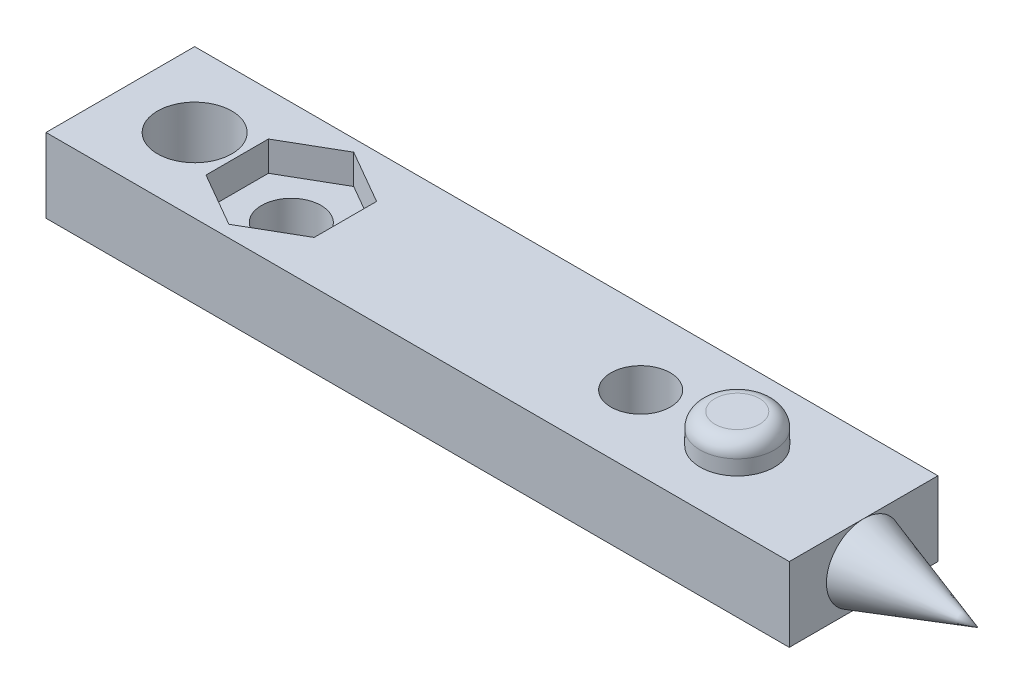
ISO-10303-21;
HEADER;
FILE_DESCRIPTION(('STEP AP214'),'2;1');
FILE_NAME('part.step','',(''),(''),'','','');
FILE_SCHEMA(('AUTOMOTIVE_DESIGN { 1 0 10303 214 1 1 1 1 }'));
ENDSEC;
DATA;
#1=APPLICATION_CONTEXT('core data for automotive mechanical design processes');
#2=APPLICATION_PROTOCOL_DEFINITION('international standard','automotive_design',2000,#1);
#3=PRODUCT_CONTEXT('',#1,'mechanical');
#4=PRODUCT('Part','Part','',(#3));
#5=PRODUCT_RELATED_PRODUCT_CATEGORY('part','',(#4));
#6=PRODUCT_DEFINITION_FORMATION('','',#4);
#7=PRODUCT_DEFINITION_CONTEXT('part definition',#1,'design');
#8=PRODUCT_DEFINITION('design','',#6,#7);
#9=PRODUCT_DEFINITION_SHAPE('','',#8);
#10=(LENGTH_UNIT() NAMED_UNIT(*) SI_UNIT(.MILLI.,.METRE.));
#11=(NAMED_UNIT(*) PLANE_ANGLE_UNIT() SI_UNIT($,.RADIAN.));
#12=(NAMED_UNIT(*) SI_UNIT($,.STERADIAN.) SOLID_ANGLE_UNIT());
#13=UNCERTAINTY_MEASURE_WITH_UNIT(LENGTH_MEASURE(1.E-05),#10,'distance_accuracy_value','');
#14=(GEOMETRIC_REPRESENTATION_CONTEXT(3) GLOBAL_UNCERTAINTY_ASSIGNED_CONTEXT((#13)) GLOBAL_UNIT_ASSIGNED_CONTEXT((#10,
#11,#12)) REPRESENTATION_CONTEXT('',''));
#15=CARTESIAN_POINT('',(0.,0.,0.));
#16=DIRECTION('',(0.,0.,1.));
#17=DIRECTION('',(1.,0.,0.));
#18=AXIS2_PLACEMENT_3D('',#15,#16,#17);
#19=CARTESIAN_POINT('',(50.,5.,0.));
#20=DIRECTION('',(-1.,0.,0.));
#21=DIRECTION('',(0.,0.,1.));
#22=AXIS2_PLACEMENT_3D('',#19,#20,#21);
#23=PLANE('',#22);
#24=CARTESIAN_POINT('',(50.,2.5,-5.));
#25=DIRECTION('',(1.,0.,0.));
#26=DIRECTION('',(0.,0.,-1.));
#27=AXIS2_PLACEMENT_3D('',#24,#25,#26);
#28=CIRCLE('',#27,2.5);
#29=CARTESIAN_POINT('',(50.,0.,-5.));
#30=VERTEX_POINT('',#29);
#31=CARTESIAN_POINT('',(50.,5.,-5.));
#32=VERTEX_POINT('',#31);
#33=EDGE_CURVE('E124',#30,#32,#28,.T.);
#34=ORIENTED_EDGE('',*,*,#33,.F.);
#35=DIRECTION('',(0.,0.,-1.));
#36=VECTOR('',#35,1.);
#37=CARTESIAN_POINT('',(50.,0.,0.));
#38=LINE('',#37,#36);
#39=CARTESIAN_POINT('',(50.,0.,-10.));
#40=VERTEX_POINT('',#39);
#41=EDGE_CURVE('E207',#30,#40,#38,.T.);
#42=ORIENTED_EDGE('',*,*,#41,.T.);
#43=DIRECTION('',(0.,-1.,0.));
#44=VECTOR('',#43,1.);
#45=CARTESIAN_POINT('',(50.,5.,-10.));
#46=LINE('',#45,#44);
#47=CARTESIAN_POINT('',(50.,5.,-10.));
#48=VERTEX_POINT('',#47);
#49=EDGE_CURVE('E213',#48,#40,#46,.T.);
#50=ORIENTED_EDGE('',*,*,#49,.F.);
#51=DIRECTION('',(0.,0.,-1.));
#52=VECTOR('',#51,1.);
#53=CARTESIAN_POINT('',(50.,5.,0.));
#54=LINE('',#53,#52);
#55=EDGE_CURVE('E196',#32,#48,#54,.T.);
#56=ORIENTED_EDGE('',*,*,#55,.F.);
#57=EDGE_LOOP('',(#34,#42,#50,#56));
#58=FACE_BOUND('',#57,.T.);
#59=ADVANCED_FACE('F33',(#58),#23,.F.);
#60=CARTESIAN_POINT('',(11.5,5.,-5.));
#61=DIRECTION('',(0.,-1.,0.));
#62=DIRECTION('',(0.,0.,-1.));
#63=AXIS2_PLACEMENT_3D('',#60,#61,#62);
#64=CYLINDRICAL_SURFACE('',#63,2.);
#65=CARTESIAN_POINT('',(11.5,0.,-5.));
#66=DIRECTION('',(0.,-1.,0.));
#67=DIRECTION('',(0.,0.,-1.));
#68=AXIS2_PLACEMENT_3D('',#65,#66,#67);
#69=CIRCLE('',#68,2.);
#70=CARTESIAN_POINT('',(11.5,0.,-7.));
#71=VERTEX_POINT('',#70);
#72=EDGE_CURVE('E177',#71,#71,#69,.T.);
#73=ORIENTED_EDGE('',*,*,#72,.T.);
#74=EDGE_LOOP('',(#73));
#75=FACE_BOUND('',#74,.T.);
#76=CARTESIAN_POINT('',(11.5,3.,-5.));
#77=DIRECTION('',(0.,1.,0.));
#78=DIRECTION('',(0.,0.,1.));
#79=AXIS2_PLACEMENT_3D('',#76,#77,#78);
#80=CIRCLE('',#79,2.);
#81=CARTESIAN_POINT('',(11.5,3.,-3.));
#82=VERTEX_POINT('',#81);
#83=EDGE_CURVE('E164',#82,#82,#80,.F.);
#84=ORIENTED_EDGE('',*,*,#83,.F.);
#85=EDGE_LOOP('',(#84));
#86=FACE_BOUND('',#85,.T.);
#87=ADVANCED_FACE('F241',(#75,#86),#64,.F.);
#88=CARTESIAN_POINT('',(0.,5.,0.));
#89=DIRECTION('',(1.,0.,0.));
#90=DIRECTION('',(0.,0.,-1.));
#91=AXIS2_PLACEMENT_3D('',#88,#89,#90);
#92=PLANE('',#91);
#93=DIRECTION('',(0.,0.,1.));
#94=VECTOR('',#93,1.);
#95=CARTESIAN_POINT('',(0.,0.,0.));
#96=LINE('',#95,#94);
#97=CARTESIAN_POINT('',(0.,0.,-10.));
#98=VERTEX_POINT('',#97);
#99=CARTESIAN_POINT('',(0.,0.,0.));
#100=VERTEX_POINT('',#99);
#101=EDGE_CURVE('E187',#98,#100,#96,.T.);
#102=ORIENTED_EDGE('',*,*,#101,.T.);
#103=DIRECTION('',(0.,-1.,0.));
#104=VECTOR('',#103,1.);
#105=CARTESIAN_POINT('',(0.,5.,0.));
#106=LINE('',#105,#104);
#107=CARTESIAN_POINT('',(0.,5.,0.));
#108=VERTEX_POINT('',#107);
#109=EDGE_CURVE('E219',#108,#100,#106,.T.);
#110=ORIENTED_EDGE('',*,*,#109,.F.);
#111=DIRECTION('',(0.,0.,1.));
#112=VECTOR('',#111,1.);
#113=CARTESIAN_POINT('',(0.,5.,0.));
#114=LINE('',#113,#112);
#115=CARTESIAN_POINT('',(0.,5.,-10.));
#116=VERTEX_POINT('',#115);
#117=EDGE_CURVE('E190',#116,#108,#114,.T.);
#118=ORIENTED_EDGE('',*,*,#117,.F.);
#119=DIRECTION('',(0.,-1.,0.));
#120=VECTOR('',#119,1.);
#121=CARTESIAN_POINT('',(0.,5.,-10.));
#122=LINE('',#121,#120);
#123=EDGE_CURVE('E202',#116,#98,#122,.T.);
#124=ORIENTED_EDGE('',*,*,#123,.T.);
#125=EDGE_LOOP('',(#102,#110,#118,#124));
#126=FACE_BOUND('',#125,.T.);
#127=ADVANCED_FACE('F249',(#126),#92,.F.);
#128=CARTESIAN_POINT('',(0.,5.,0.));
#129=DIRECTION('',(0.,0.,-1.));
#130=DIRECTION('',(-1.,0.,0.));
#131=AXIS2_PLACEMENT_3D('',#128,#129,#130);
#132=PLANE('',#131);
#133=DIRECTION('',(1.,0.,0.));
#134=VECTOR('',#133,1.);
#135=CARTESIAN_POINT('',(0.,0.,0.));
#136=LINE('',#135,#134);
#137=CARTESIAN_POINT('',(50.,0.,0.));
#138=VERTEX_POINT('',#137);
#139=EDGE_CURVE('E205',#100,#138,#136,.T.);
#140=ORIENTED_EDGE('',*,*,#139,.T.);
#141=DIRECTION('',(0.,-1.,0.));
#142=VECTOR('',#141,1.);
#143=CARTESIAN_POINT('',(50.,5.,0.));
#144=LINE('',#143,#142);
#145=CARTESIAN_POINT('',(50.,5.,0.));
#146=VERTEX_POINT('',#145);
#147=EDGE_CURVE('E216',#146,#138,#144,.T.);
#148=ORIENTED_EDGE('',*,*,#147,.F.);
#149=DIRECTION('',(1.,0.,0.));
#150=VECTOR('',#149,1.);
#151=CARTESIAN_POINT('',(0.,5.,0.));
#152=LINE('',#151,#150);
#153=EDGE_CURVE('E193',#108,#146,#152,.T.);
#154=ORIENTED_EDGE('',*,*,#153,.F.);
#155=ORIENTED_EDGE('',*,*,#109,.T.);
#156=EDGE_LOOP('',(#140,#148,#154,#155));
#157=FACE_BOUND('',#156,.T.);
#158=ADVANCED_FACE('F255',(#157),#132,.F.);
#159=EDGE_CURVE('E48',#32,#30,#28,.T.);
#160=ORIENTED_EDGE('',*,*,#159,.F.);
#161=EDGE_CURVE('E197',#146,#32,#54,.T.);
#162=ORIENTED_EDGE('',*,*,#161,.F.);
#163=ORIENTED_EDGE('',*,*,#147,.T.);
#164=EDGE_CURVE('E208',#138,#30,#38,.T.);
#165=ORIENTED_EDGE('',*,*,#164,.T.);
#166=EDGE_LOOP('',(#160,#162,#163,#165));
#167=FACE_BOUND('',#166,.T.);
#168=ADVANCED_FACE('F244',(#167),#23,.F.);
#169=CARTESIAN_POINT('',(0.,5.,-10.));
#170=DIRECTION('',(0.,0.,1.));
#171=DIRECTION('',(1.,0.,0.));
#172=AXIS2_PLACEMENT_3D('',#169,#170,#171);
#173=PLANE('',#172);
#174=DIRECTION('',(-1.,0.,0.));
#175=VECTOR('',#174,1.);
#176=CARTESIAN_POINT('',(0.,0.,-10.));
#177=LINE('',#176,#175);
#178=EDGE_CURVE('E194',#40,#98,#177,.T.);
#179=ORIENTED_EDGE('',*,*,#178,.T.);
#180=ORIENTED_EDGE('',*,*,#123,.F.);
#181=DIRECTION('',(-1.,0.,0.));
#182=VECTOR('',#181,1.);
#183=CARTESIAN_POINT('',(0.,5.,-10.));
#184=LINE('',#183,#182);
#185=EDGE_CURVE('E200',#48,#116,#184,.T.);
#186=ORIENTED_EDGE('',*,*,#185,.F.);
#187=ORIENTED_EDGE('',*,*,#49,.T.);
#188=EDGE_LOOP('',(#179,#180,#186,#187));
#189=FACE_BOUND('',#188,.T.);
#190=ADVANCED_FACE('F254',(#189),#173,.F.);
#191=CARTESIAN_POINT('',(0.,5.,0.));
#192=DIRECTION('',(0.,-1.,0.));
#193=DIRECTION('',(0.,0.,-1.));
#194=AXIS2_PLACEMENT_3D('',#191,#192,#193);
#195=PLANE('',#194);
#196=CARTESIAN_POINT('',(41.5,5.,-5.));
#197=DIRECTION('',(0.,-1.,0.));
#198=DIRECTION('',(0.,0.,-1.));
#199=AXIS2_PLACEMENT_3D('',#196,#197,#198);
#200=CIRCLE('',#199,2.5);
#201=CARTESIAN_POINT('',(41.5,5.,-7.5));
#202=VERTEX_POINT('',#201);
#203=EDGE_CURVE('E222',#202,#202,#200,.F.);
#204=ORIENTED_EDGE('',*,*,#203,.F.);
#205=EDGE_LOOP('',(#204));
#206=FACE_BOUND('',#205,.T.);
#207=DIRECTION('',(0.866025403784438,0.,-0.5));
#208=VECTOR('',#207,1.);
#209=CARTESIAN_POINT('',(11.5,5.,-0.799999999999965));
#210=LINE('',#209,#208);
#211=CARTESIAN_POINT('',(11.5,5.,-0.799999999999965));
#212=VERTEX_POINT('',#211);
#213=CARTESIAN_POINT('',(15.1373066958947,5.,-2.89999999999998));
#214=VERTEX_POINT('',#213);
#215=EDGE_CURVE('E126',#212,#214,#210,.T.);
#216=ORIENTED_EDGE('',*,*,#215,.F.);
#217=DIRECTION('',(0.866025403784439,0.,0.5));
#218=VECTOR('',#217,1.);
#219=CARTESIAN_POINT('',(7.86269330410533,5.,-2.89999999999998));
#220=LINE('',#219,#218);
#221=CARTESIAN_POINT('',(7.86269330410533,5.,-2.89999999999998));
#222=VERTEX_POINT('',#221);
#223=EDGE_CURVE('E56',#222,#212,#220,.T.);
#224=ORIENTED_EDGE('',*,*,#223,.F.);
#225=DIRECTION('',(0.,0.,1.));
#226=VECTOR('',#225,1.);
#227=CARTESIAN_POINT('',(7.86269330410533,5.,-7.10000000000001));
#228=LINE('',#227,#226);
#229=CARTESIAN_POINT('',(7.86269330410533,5.,-7.10000000000001));
#230=VERTEX_POINT('',#229);
#231=EDGE_CURVE('E133',#230,#222,#228,.T.);
#232=ORIENTED_EDGE('',*,*,#231,.F.);
#233=DIRECTION('',(-0.866025403784439,0.,0.5));
#234=VECTOR('',#233,1.);
#235=CARTESIAN_POINT('',(11.5,5.,-9.20000000000003));
#236=LINE('',#235,#234);
#237=CARTESIAN_POINT('',(11.5,5.,-9.20000000000003));
#238=VERTEX_POINT('',#237);
#239=EDGE_CURVE('E157',#238,#230,#236,.T.);
#240=ORIENTED_EDGE('',*,*,#239,.F.);
#241=DIRECTION('',(-0.866025403784438,0.,-0.5));
#242=VECTOR('',#241,1.);
#243=CARTESIAN_POINT('',(15.1373066958947,5.,-7.10000000000001));
#244=LINE('',#243,#242);
#245=CARTESIAN_POINT('',(15.1373066958947,5.,-7.10000000000001));
#246=VERTEX_POINT('',#245);
#247=EDGE_CURVE('E154',#246,#238,#244,.T.);
#248=ORIENTED_EDGE('',*,*,#247,.F.);
#249=DIRECTION('',(0.,0.,-1.));
#250=VECTOR('',#249,1.);
#251=CARTESIAN_POINT('',(15.1373066958947,5.,-2.89999999999998));
#252=LINE('',#251,#250);
#253=EDGE_CURVE('E151',#214,#246,#252,.T.);
#254=ORIENTED_EDGE('',*,*,#253,.F.);
#255=EDGE_LOOP('',(#216,#224,#232,#240,#248,#254));
#256=FACE_BOUND('',#255,.T.);
#257=CARTESIAN_POINT('',(35.,5.,-5.));
#258=DIRECTION('',(0.,1.,0.));
#259=DIRECTION('',(0.,0.,1.));
#260=AXIS2_PLACEMENT_3D('',#257,#258,#259);
#261=CIRCLE('',#260,2.);
#262=CARTESIAN_POINT('',(35.,5.,-3.));
#263=VERTEX_POINT('',#262);
#264=EDGE_CURVE('E178',#263,#263,#261,.T.);
#265=ORIENTED_EDGE('',*,*,#264,.F.);
#266=EDGE_LOOP('',(#265));
#267=FACE_BOUND('',#266,.T.);
#268=CARTESIAN_POINT('',(5.,5.,-5.));
#269=DIRECTION('',(0.,-1.,0.));
#270=DIRECTION('',(0.,0.,-1.));
#271=AXIS2_PLACEMENT_3D('',#268,#269,#270);
#272=CIRCLE('',#271,2.5);
#273=CARTESIAN_POINT('',(5.,5.,-7.5));
#274=VERTEX_POINT('',#273);
#275=EDGE_CURVE('E184',#274,#274,#272,.T.);
#276=ORIENTED_EDGE('',*,*,#275,.T.);
#277=EDGE_LOOP('',(#276));
#278=FACE_BOUND('',#277,.T.);
#279=ORIENTED_EDGE('',*,*,#117,.T.);
#280=ORIENTED_EDGE('',*,*,#153,.T.);
#281=ORIENTED_EDGE('',*,*,#161,.T.);
#282=ORIENTED_EDGE('',*,*,#55,.T.);
#283=ORIENTED_EDGE('',*,*,#185,.T.);
#284=EDGE_LOOP('',(#279,#280,#281,#282,#283));
#285=FACE_BOUND('',#284,.T.);
#286=ADVANCED_FACE('F260',(#206,#256,#267,#278,#285),#195,.F.);
#287=CARTESIAN_POINT('',(0.,0.,0.));
#288=DIRECTION('',(0.,-1.,0.));
#289=DIRECTION('',(0.,0.,-1.));
#290=AXIS2_PLACEMENT_3D('',#287,#288,#289);
#291=PLANE('',#290);
#292=CARTESIAN_POINT('',(35.,0.,-5.));
#293=DIRECTION('',(0.,1.,0.));
#294=DIRECTION('',(0.,0.,1.));
#295=AXIS2_PLACEMENT_3D('',#292,#293,#294);
#296=CIRCLE('',#295,2.);
#297=CARTESIAN_POINT('',(35.,0.,-3.));
#298=VERTEX_POINT('',#297);
#299=EDGE_CURVE('E174',#298,#298,#296,.T.);
#300=ORIENTED_EDGE('',*,*,#299,.T.);
#301=EDGE_LOOP('',(#300));
#302=FACE_BOUND('',#301,.T.);
#303=ORIENTED_EDGE('',*,*,#72,.F.);
#304=EDGE_LOOP('',(#303));
#305=FACE_BOUND('',#304,.T.);
#306=CARTESIAN_POINT('',(5.,0.,-5.));
#307=DIRECTION('',(0.,-1.,0.));
#308=DIRECTION('',(0.,0.,-1.));
#309=AXIS2_PLACEMENT_3D('',#306,#307,#308);
#310=CIRCLE('',#309,2.5);
#311=CARTESIAN_POINT('',(5.,0.,-7.5));
#312=VERTEX_POINT('',#311);
#313=EDGE_CURVE('E183',#312,#312,#310,.T.);
#314=ORIENTED_EDGE('',*,*,#313,.F.);
#315=EDGE_LOOP('',(#314));
#316=FACE_BOUND('',#315,.T.);
#317=ORIENTED_EDGE('',*,*,#101,.F.);
#318=ORIENTED_EDGE('',*,*,#178,.F.);
#319=ORIENTED_EDGE('',*,*,#41,.F.);
#320=ORIENTED_EDGE('',*,*,#164,.F.);
#321=ORIENTED_EDGE('',*,*,#139,.F.);
#322=EDGE_LOOP('',(#317,#318,#319,#320,#321));
#323=FACE_BOUND('',#322,.T.);
#324=ADVANCED_FACE('F274',(#302,#305,#316,#323),#291,.T.);
#325=CARTESIAN_POINT('',(5.,5.,-5.));
#326=DIRECTION('',(0.,-1.,0.));
#327=DIRECTION('',(0.,0.,-1.));
#328=AXIS2_PLACEMENT_3D('',#325,#326,#327);
#329=CYLINDRICAL_SURFACE('',#328,2.5);
#330=ORIENTED_EDGE('',*,*,#275,.F.);
#331=EDGE_LOOP('',(#330));
#332=FACE_BOUND('',#331,.T.);
#333=ORIENTED_EDGE('',*,*,#313,.T.);
#334=EDGE_LOOP('',(#333));
#335=FACE_BOUND('',#334,.T.);
#336=ADVANCED_FACE('F286',(#332,#335),#329,.F.);
#337=CARTESIAN_POINT('',(35.,0.,-5.));
#338=DIRECTION('',(0.,1.,0.));
#339=DIRECTION('',(0.,0.,1.));
#340=AXIS2_PLACEMENT_3D('',#337,#338,#339);
#341=CYLINDRICAL_SURFACE('',#340,2.);
#342=ORIENTED_EDGE('',*,*,#299,.F.);
#343=EDGE_LOOP('',(#342));
#344=FACE_BOUND('',#343,.T.);
#345=ORIENTED_EDGE('',*,*,#264,.T.);
#346=EDGE_LOOP('',(#345));
#347=FACE_BOUND('',#346,.T.);
#348=ADVANCED_FACE('F293',(#344,#347),#341,.F.);
#349=CARTESIAN_POINT('',(0.,3.,0.));
#350=DIRECTION('',(0.,1.,0.));
#351=DIRECTION('',(0.,0.,1.));
#352=AXIS2_PLACEMENT_3D('',#349,#350,#351);
#353=PLANE('',#352);
#354=DIRECTION('',(0.866025403784439,0.,0.5));
#355=VECTOR('',#354,1.);
#356=CARTESIAN_POINT('',(7.86269330410533,3.,-2.89999999999998));
#357=LINE('',#356,#355);
#358=CARTESIAN_POINT('',(7.86269330410533,3.,-2.89999999999998));
#359=VERTEX_POINT('',#358);
#360=CARTESIAN_POINT('',(11.5,3.,-0.799999999999965));
#361=VERTEX_POINT('',#360);
#362=EDGE_CURVE('E129',#359,#361,#357,.T.);
#363=ORIENTED_EDGE('',*,*,#362,.T.);
#364=DIRECTION('',(0.866025403784438,0.,-0.5));
#365=VECTOR('',#364,1.);
#366=CARTESIAN_POINT('',(11.5,3.,-0.799999999999965));
#367=LINE('',#366,#365);
#368=CARTESIAN_POINT('',(15.1373066958947,3.,-2.89999999999998));
#369=VERTEX_POINT('',#368);
#370=EDGE_CURVE('E132',#361,#369,#367,.T.);
#371=ORIENTED_EDGE('',*,*,#370,.T.);
#372=DIRECTION('',(0.,0.,-1.));
#373=VECTOR('',#372,1.);
#374=CARTESIAN_POINT('',(15.1373066958947,3.,-2.89999999999998));
#375=LINE('',#374,#373);
#376=CARTESIAN_POINT('',(15.1373066958947,3.,-7.10000000000001));
#377=VERTEX_POINT('',#376);
#378=EDGE_CURVE('E136',#369,#377,#375,.T.);
#379=ORIENTED_EDGE('',*,*,#378,.T.);
#380=DIRECTION('',(-0.866025403784438,0.,-0.5));
#381=VECTOR('',#380,1.);
#382=CARTESIAN_POINT('',(15.1373066958947,3.,-7.10000000000001));
#383=LINE('',#382,#381);
#384=CARTESIAN_POINT('',(11.5,3.,-9.20000000000003));
#385=VERTEX_POINT('',#384);
#386=EDGE_CURVE('E139',#377,#385,#383,.T.);
#387=ORIENTED_EDGE('',*,*,#386,.T.);
#388=DIRECTION('',(-0.866025403784439,0.,0.5));
#389=VECTOR('',#388,1.);
#390=CARTESIAN_POINT('',(11.5,3.,-9.20000000000003));
#391=LINE('',#390,#389);
#392=CARTESIAN_POINT('',(7.86269330410533,3.,-7.10000000000001));
#393=VERTEX_POINT('',#392);
#394=EDGE_CURVE('E142',#385,#393,#391,.T.);
#395=ORIENTED_EDGE('',*,*,#394,.T.);
#396=DIRECTION('',(0.,0.,1.));
#397=VECTOR('',#396,1.);
#398=CARTESIAN_POINT('',(7.86269330410533,3.,-7.10000000000001));
#399=LINE('',#398,#397);
#400=EDGE_CURVE('E145',#393,#359,#399,.T.);
#401=ORIENTED_EDGE('',*,*,#400,.T.);
#402=EDGE_LOOP('',(#363,#371,#379,#387,#395,#401));
#403=FACE_BOUND('',#402,.T.);
#404=ORIENTED_EDGE('',*,*,#83,.T.);
#405=EDGE_LOOP('',(#404));
#406=FACE_BOUND('',#405,.T.);
#407=ADVANCED_FACE('F298',(#403,#406),#353,.T.);
#408=CARTESIAN_POINT('',(7.86269330410533,3.,-2.89999999999998));
#409=DIRECTION('',(-0.5,0.,0.866025403784439));
#410=DIRECTION('',(0.866025403784439,0.,0.5));
#411=AXIS2_PLACEMENT_3D('',#408,#409,#410);
#412=PLANE('',#411);
#413=ORIENTED_EDGE('',*,*,#223,.T.);
#414=DIRECTION('',(0.,1.,0.));
#415=VECTOR('',#414,1.);
#416=CARTESIAN_POINT('',(11.5,3.,-0.799999999999965));
#417=LINE('',#416,#415);
#418=EDGE_CURVE('E147',#361,#212,#417,.T.);
#419=ORIENTED_EDGE('',*,*,#418,.F.);
#420=ORIENTED_EDGE('',*,*,#362,.F.);
#421=DIRECTION('',(0.,1.,0.));
#422=VECTOR('',#421,1.);
#423=CARTESIAN_POINT('',(7.86269330410533,3.,-2.89999999999998));
#424=LINE('',#423,#422);
#425=EDGE_CURVE('E162',#359,#222,#424,.T.);
#426=ORIENTED_EDGE('',*,*,#425,.T.);
#427=EDGE_LOOP('',(#413,#419,#420,#426));
#428=FACE_BOUND('',#427,.T.);
#429=ADVANCED_FACE('F300',(#428),#412,.F.);
#430=CARTESIAN_POINT('',(7.86269330410533,3.,-7.10000000000001));
#431=DIRECTION('',(-1.,0.,0.));
#432=DIRECTION('',(0.,0.,1.));
#433=AXIS2_PLACEMENT_3D('',#430,#431,#432);
#434=PLANE('',#433);
#435=ORIENTED_EDGE('',*,*,#231,.T.);
#436=ORIENTED_EDGE('',*,*,#425,.F.);
#437=ORIENTED_EDGE('',*,*,#400,.F.);
#438=DIRECTION('',(0.,1.,0.));
#439=VECTOR('',#438,1.);
#440=CARTESIAN_POINT('',(7.86269330410533,3.,-7.10000000000001));
#441=LINE('',#440,#439);
#442=EDGE_CURVE('E165',#393,#230,#441,.T.);
#443=ORIENTED_EDGE('',*,*,#442,.T.);
#444=EDGE_LOOP('',(#435,#436,#437,#443));
#445=FACE_BOUND('',#444,.T.);
#446=ADVANCED_FACE('F303',(#445),#434,.F.);
#447=CARTESIAN_POINT('',(11.5,3.,-9.20000000000003));
#448=DIRECTION('',(-0.5,0.,-0.866025403784439));
#449=DIRECTION('',(-0.866025403784439,0.,0.5));
#450=AXIS2_PLACEMENT_3D('',#447,#448,#449);
#451=PLANE('',#450);
#452=ORIENTED_EDGE('',*,*,#239,.T.);
#453=ORIENTED_EDGE('',*,*,#442,.F.);
#454=ORIENTED_EDGE('',*,*,#394,.F.);
#455=DIRECTION('',(0.,1.,0.));
#456=VECTOR('',#455,1.);
#457=CARTESIAN_POINT('',(11.5,3.,-9.20000000000003));
#458=LINE('',#457,#456);
#459=EDGE_CURVE('E167',#385,#238,#458,.T.);
#460=ORIENTED_EDGE('',*,*,#459,.T.);
#461=EDGE_LOOP('',(#452,#453,#454,#460));
#462=FACE_BOUND('',#461,.T.);
#463=ADVANCED_FACE('F315',(#462),#451,.F.);
#464=CARTESIAN_POINT('',(15.1373066958947,3.,-7.10000000000001));
#465=DIRECTION('',(0.5,0.,-0.866025403784439));
#466=DIRECTION('',(-0.866025403784438,0.,-0.5));
#467=AXIS2_PLACEMENT_3D('',#464,#465,#466);
#468=PLANE('',#467);
#469=ORIENTED_EDGE('',*,*,#247,.T.);
#470=ORIENTED_EDGE('',*,*,#459,.F.);
#471=ORIENTED_EDGE('',*,*,#386,.F.);
#472=DIRECTION('',(0.,1.,0.));
#473=VECTOR('',#472,1.);
#474=CARTESIAN_POINT('',(15.1373066958947,3.,-7.10000000000001));
#475=LINE('',#474,#473);
#476=EDGE_CURVE('E169',#377,#246,#475,.T.);
#477=ORIENTED_EDGE('',*,*,#476,.T.);
#478=EDGE_LOOP('',(#469,#470,#471,#477));
#479=FACE_BOUND('',#478,.T.);
#480=ADVANCED_FACE('F311',(#479),#468,.F.);
#481=CARTESIAN_POINT('',(15.1373066958947,3.,-2.89999999999998));
#482=DIRECTION('',(1.,0.,0.));
#483=DIRECTION('',(0.,0.,-1.));
#484=AXIS2_PLACEMENT_3D('',#481,#482,#483);
#485=PLANE('',#484);
#486=ORIENTED_EDGE('',*,*,#253,.T.);
#487=ORIENTED_EDGE('',*,*,#476,.F.);
#488=ORIENTED_EDGE('',*,*,#378,.F.);
#489=DIRECTION('',(0.,1.,0.));
#490=VECTOR('',#489,1.);
#491=CARTESIAN_POINT('',(15.1373066958947,3.,-2.89999999999998));
#492=LINE('',#491,#490);
#493=EDGE_CURVE('E171',#369,#214,#492,.T.);
#494=ORIENTED_EDGE('',*,*,#493,.T.);
#495=EDGE_LOOP('',(#486,#487,#488,#494));
#496=FACE_BOUND('',#495,.T.);
#497=ADVANCED_FACE('F307',(#496),#485,.F.);
#498=CARTESIAN_POINT('',(11.5,3.,-0.799999999999965));
#499=DIRECTION('',(0.5,0.,0.866025403784439));
#500=DIRECTION('',(0.866025403784438,0.,-0.5));
#501=AXIS2_PLACEMENT_3D('',#498,#499,#500);
#502=PLANE('',#501);
#503=ORIENTED_EDGE('',*,*,#215,.T.);
#504=ORIENTED_EDGE('',*,*,#493,.F.);
#505=ORIENTED_EDGE('',*,*,#370,.F.);
#506=ORIENTED_EDGE('',*,*,#418,.T.);
#507=EDGE_LOOP('',(#503,#504,#505,#506));
#508=FACE_BOUND('',#507,.T.);
#509=ADVANCED_FACE('F304',(#508),#502,.F.);
#510=CARTESIAN_POINT('',(41.5,7.,-5.));
#511=DIRECTION('',(0.,-1.,0.));
#512=DIRECTION('',(0.,0.,-1.));
#513=AXIS2_PLACEMENT_3D('',#510,#511,#512);
#514=CYLINDRICAL_SURFACE('',#513,2.5);
#515=CARTESIAN_POINT('',(41.5,6.,-5.));
#516=DIRECTION('',(0.,1.,0.));
#517=DIRECTION('',(0.,0.,1.));
#518=AXIS2_PLACEMENT_3D('',#515,#516,#517);
#519=CIRCLE('',#518,2.5);
#520=CARTESIAN_POINT('',(41.5,6.,-2.5));
#521=VERTEX_POINT('',#520);
#522=EDGE_CURVE('E11',#521,#521,#519,.F.);
#523=ORIENTED_EDGE('',*,*,#522,.T.);
#524=EDGE_LOOP('',(#523));
#525=FACE_BOUND('',#524,.T.);
#526=ORIENTED_EDGE('',*,*,#203,.T.);
#527=EDGE_LOOP('',(#526));
#528=FACE_BOUND('',#527,.T.);
#529=ADVANCED_FACE('F237',(#525,#528),#514,.T.);
#530=CARTESIAN_POINT('',(41.5,7.,-5.));
#531=DIRECTION('',(0.,1.,0.));
#532=DIRECTION('',(0.,0.,1.));
#533=AXIS2_PLACEMENT_3D('',#530,#531,#532);
#534=PLANE('',#533);
#535=CARTESIAN_POINT('',(41.5,7.,-5.));
#536=DIRECTION('',(0.,1.,0.));
#537=DIRECTION('',(0.,0.,1.));
#538=AXIS2_PLACEMENT_3D('',#535,#536,#537);
#539=CIRCLE('',#538,1.5);
#540=CARTESIAN_POINT('',(41.5,7.,-3.5));
#541=VERTEX_POINT('',#540);
#542=EDGE_CURVE('E41',#541,#541,#539,.T.);
#543=ORIENTED_EDGE('',*,*,#542,.T.);
#544=EDGE_LOOP('',(#543));
#545=FACE_BOUND('',#544,.T.);
#546=ADVANCED_FACE('F229',(#545),#534,.T.);
#547=CARTESIAN_POINT('',(41.5,6.,-5.));
#548=DIRECTION('',(0.,1.,0.));
#549=DIRECTION('',(0.,0.,1.));
#550=AXIS2_PLACEMENT_3D('',#547,#548,#549);
#551=TOROIDAL_SURFACE('',#550,1.5,1.);
#552=ORIENTED_EDGE('',*,*,#522,.F.);
#553=EDGE_LOOP('',(#552));
#554=FACE_BOUND('',#553,.T.);
#555=ORIENTED_EDGE('',*,*,#542,.F.);
#556=EDGE_LOOP('',(#555));
#557=FACE_BOUND('',#556,.T.);
#558=ADVANCED_FACE('F35',(#554,#557),#551,.T.);
#559=CARTESIAN_POINT('',(50.,2.5,-5.));
#560=DIRECTION('',(-1.,0.,0.));
#561=DIRECTION('',(0.,0.,-1.));
#562=AXIS2_PLACEMENT_3D('',#559,#560,#561);
#563=CONICAL_SURFACE('',#562,2.5,0.31415926535898);
#564=CARTESIAN_POINT('',(57.6942088429381,2.5,-5.));
#565=VERTEX_POINT('',#564);
#566=VERTEX_LOOP('',#565);
#567=FACE_BOUND('',#566,.T.);
#568=ORIENTED_EDGE('',*,*,#159,.T.);
#569=ORIENTED_EDGE('',*,*,#33,.T.);
#570=EDGE_LOOP('',(#568,#569));
#571=FACE_BOUND('',#570,.T.);
#572=ADVANCED_FACE('F118',(#567,#571),#563,.T.);
#573=CLOSED_SHELL('',(#59,#87,#127,#158,#168,#190,#286,#324,#336,#348,#407,#429,#446,#463,#480,
#497,#509,#529,#546,#558,#572));
#574=MANIFOLD_SOLID_BREP('B2',#573);
#575=ADVANCED_BREP_SHAPE_REPRESENTATION('',(#18,#574),#14);
#576=SHAPE_DEFINITION_REPRESENTATION(#9,#575);
ENDSEC;
END-ISO-10303-21;
